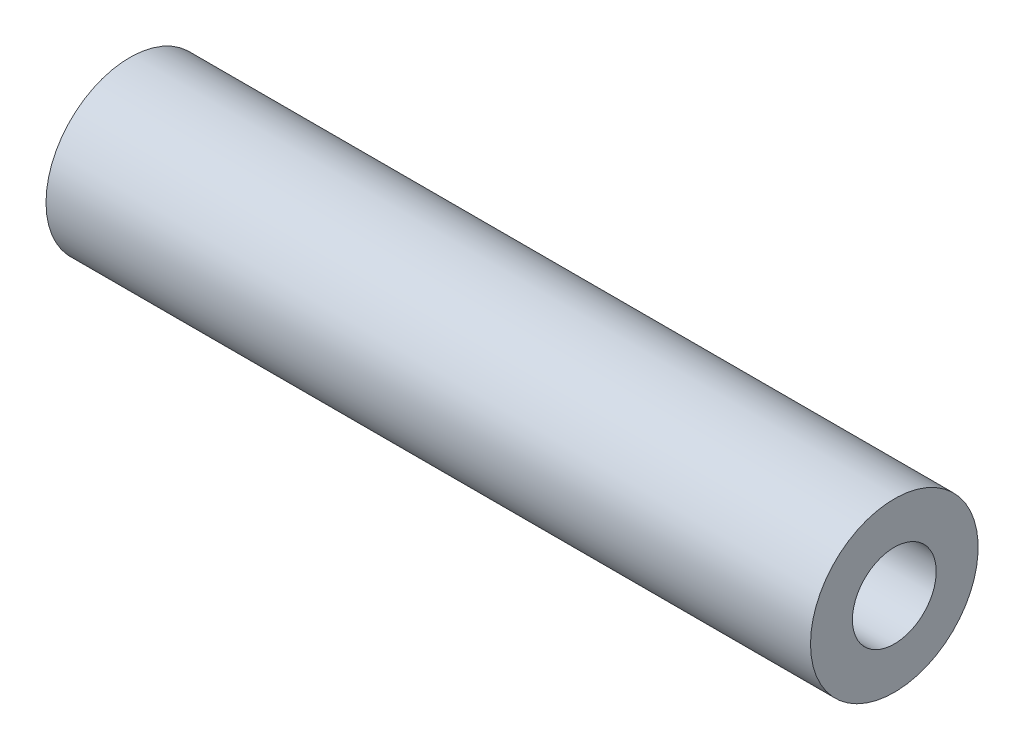
ISO-10303-21;
HEADER;
FILE_DESCRIPTION(('STEP AP214'),'2;1');
FILE_NAME('part.step','',(''),(''),'','','');
FILE_SCHEMA(('AUTOMOTIVE_DESIGN { 1 0 10303 214 1 1 1 1 }'));
ENDSEC;
DATA;
#1=APPLICATION_CONTEXT('core data for automotive mechanical design processes');
#2=APPLICATION_PROTOCOL_DEFINITION('international standard','automotive_design',2000,#1);
#3=PRODUCT_CONTEXT('',#1,'mechanical');
#4=PRODUCT('Part','Part','',(#3));
#5=PRODUCT_RELATED_PRODUCT_CATEGORY('part','',(#4));
#6=PRODUCT_DEFINITION_FORMATION('','',#4);
#7=PRODUCT_DEFINITION_CONTEXT('part definition',#1,'design');
#8=PRODUCT_DEFINITION('design','',#6,#7);
#9=PRODUCT_DEFINITION_SHAPE('','',#8);
#10=(LENGTH_UNIT() NAMED_UNIT(*) SI_UNIT(.MILLI.,.METRE.));
#11=(NAMED_UNIT(*) PLANE_ANGLE_UNIT() SI_UNIT($,.RADIAN.));
#12=(NAMED_UNIT(*) SI_UNIT($,.STERADIAN.) SOLID_ANGLE_UNIT());
#13=UNCERTAINTY_MEASURE_WITH_UNIT(LENGTH_MEASURE(1.E-05),#10,'distance_accuracy_value','');
#14=(GEOMETRIC_REPRESENTATION_CONTEXT(3) GLOBAL_UNCERTAINTY_ASSIGNED_CONTEXT((#13)) GLOBAL_UNIT_ASSIGNED_CONTEXT((#10,
#11,#12)) REPRESENTATION_CONTEXT('',''));
#15=CARTESIAN_POINT('',(0.,0.,0.));
#16=DIRECTION('',(0.,0.,1.));
#17=DIRECTION('',(1.,0.,0.));
#18=AXIS2_PLACEMENT_3D('',#15,#16,#17);
#19=CARTESIAN_POINT('',(0.,0.,0.));
#20=DIRECTION('',(1.,0.,0.));
#21=DIRECTION('',(0.,0.,-1.));
#22=AXIS2_PLACEMENT_3D('',#19,#20,#21);
#23=PLANE('',#22);
#24=CARTESIAN_POINT('',(0.,0.,0.));
#25=DIRECTION('',(-1.,0.,0.));
#26=DIRECTION('',(0.,0.,1.));
#27=AXIS2_PLACEMENT_3D('',#24,#25,#26);
#28=CIRCLE('',#27,1.24999999999999);
#29=CARTESIAN_POINT('',(0.,0.,1.24999999999999));
#30=VERTEX_POINT('',#29);
#31=EDGE_CURVE('E44',#30,#30,#28,.T.);
#32=ORIENTED_EDGE('',*,*,#31,.F.);
#33=EDGE_LOOP('',(#32));
#34=FACE_BOUND('',#33,.T.);
#35=CARTESIAN_POINT('',(0.,0.,0.));
#36=DIRECTION('',(-1.,0.,0.));
#37=DIRECTION('',(0.,0.,1.));
#38=AXIS2_PLACEMENT_3D('',#35,#36,#37);
#39=CIRCLE('',#38,2.5);
#40=CARTESIAN_POINT('',(0.,0.,2.5));
#41=VERTEX_POINT('',#40);
#42=EDGE_CURVE('E10',#41,#41,#39,.T.);
#43=ORIENTED_EDGE('',*,*,#42,.T.);
#44=EDGE_LOOP('',(#43));
#45=FACE_BOUND('',#44,.T.);
#46=ADVANCED_FACE('F30',(#34,#45),#23,.F.);
#47=CARTESIAN_POINT('',(-10.3052902414385,0.,0.));
#48=DIRECTION('',(-1.,0.,0.));
#49=DIRECTION('',(0.,0.,1.));
#50=AXIS2_PLACEMENT_3D('',#47,#48,#49);
#51=CYLINDRICAL_SURFACE('',#50,2.5);
#52=ORIENTED_EDGE('',*,*,#42,.F.);
#53=EDGE_LOOP('',(#52));
#54=FACE_BOUND('',#53,.T.);
#55=CARTESIAN_POINT('',(22.8,0.,0.));
#56=DIRECTION('',(-1.,0.,0.));
#57=DIRECTION('',(0.,0.,1.));
#58=AXIS2_PLACEMENT_3D('',#55,#56,#57);
#59=CIRCLE('',#58,2.5);
#60=CARTESIAN_POINT('',(22.8,0.,2.5));
#61=VERTEX_POINT('',#60);
#62=EDGE_CURVE('E36',#61,#61,#59,.T.);
#63=ORIENTED_EDGE('',*,*,#62,.T.);
#64=EDGE_LOOP('',(#63));
#65=FACE_BOUND('',#64,.T.);
#66=ADVANCED_FACE('F53',(#54,#65),#51,.T.);
#67=CARTESIAN_POINT('',(22.8,2.5,0.));
#68=DIRECTION('',(-1.,0.,0.));
#69=DIRECTION('',(0.,0.,1.));
#70=AXIS2_PLACEMENT_3D('',#67,#68,#69);
#71=PLANE('',#70);
#72=CARTESIAN_POINT('',(22.8,0.,0.));
#73=DIRECTION('',(-1.,0.,0.));
#74=DIRECTION('',(0.,0.,1.));
#75=AXIS2_PLACEMENT_3D('',#72,#73,#74);
#76=CIRCLE('',#75,1.25);
#77=CARTESIAN_POINT('',(22.8,0.,1.25));
#78=VERTEX_POINT('',#77);
#79=EDGE_CURVE('E40',#78,#78,#76,.T.);
#80=ORIENTED_EDGE('',*,*,#79,.T.);
#81=EDGE_LOOP('',(#80));
#82=FACE_BOUND('',#81,.T.);
#83=ORIENTED_EDGE('',*,*,#62,.F.);
#84=EDGE_LOOP('',(#83));
#85=FACE_BOUND('',#84,.T.);
#86=ADVANCED_FACE('F57',(#82,#85),#71,.F.);
#87=CARTESIAN_POINT('',(0.,0.,0.));
#88=DIRECTION('',(-1.,0.,0.));
#89=DIRECTION('',(0.,0.,1.));
#90=AXIS2_PLACEMENT_3D('',#87,#88,#89);
#91=CYLINDRICAL_SURFACE('',#90,1.24999999999999);
#92=ORIENTED_EDGE('',*,*,#79,.F.);
#93=EDGE_LOOP('',(#92));
#94=FACE_BOUND('',#93,.T.);
#95=ORIENTED_EDGE('',*,*,#31,.T.);
#96=EDGE_LOOP('',(#95));
#97=FACE_BOUND('',#96,.T.);
#98=ADVANCED_FACE('F50',(#94,#97),#91,.F.);
#99=CLOSED_SHELL('',(#46,#66,#86,#98));
#100=MANIFOLD_SOLID_BREP('B2',#99);
#101=ADVANCED_BREP_SHAPE_REPRESENTATION('',(#18,#100),#14);
#102=SHAPE_DEFINITION_REPRESENTATION(#9,#101);
ENDSEC;
END-ISO-10303-21;
